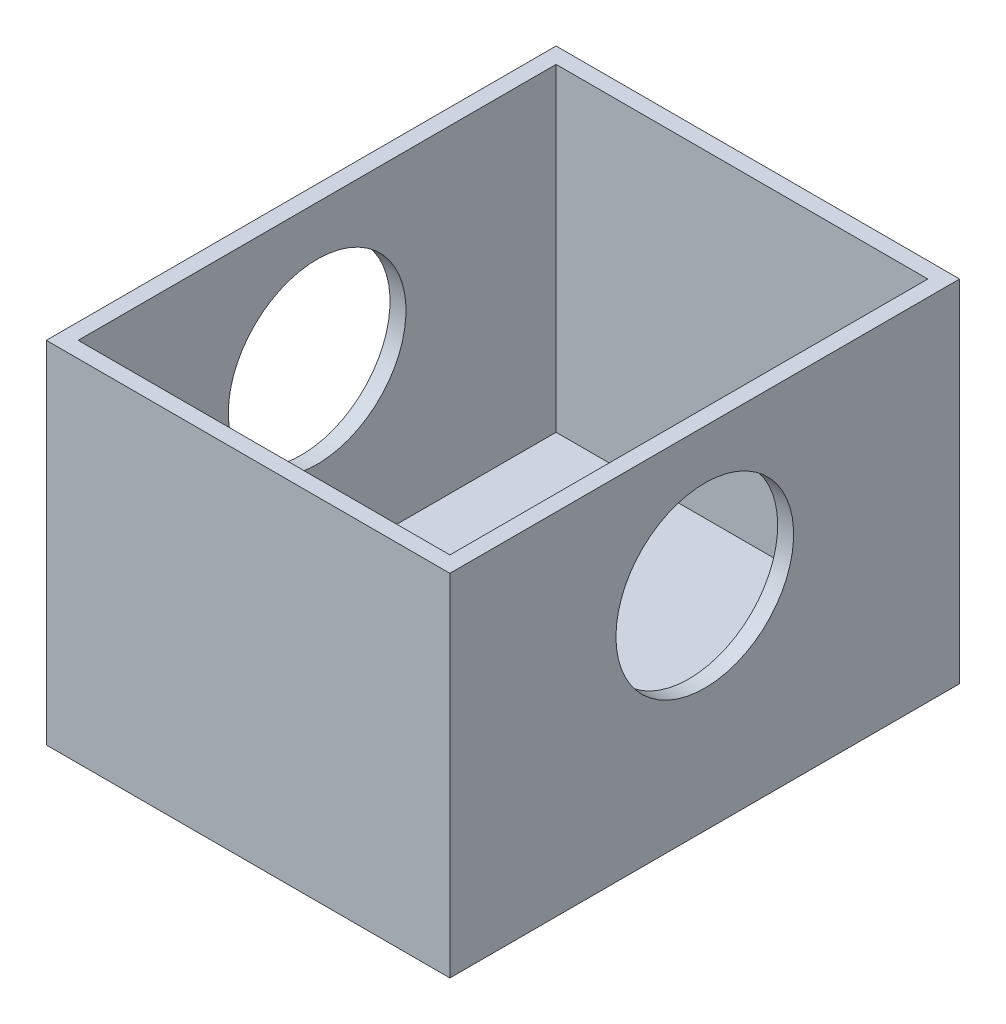
ISO-10303-21;
HEADER;
FILE_DESCRIPTION(('STEP AP214'),'2;1');
FILE_NAME('part.step','',(''),(''),'','','');
FILE_SCHEMA(('AUTOMOTIVE_DESIGN { 1 0 10303 214 1 1 1 1 }'));
ENDSEC;
DATA;
#1=APPLICATION_CONTEXT('core data for automotive mechanical design processes');
#2=APPLICATION_PROTOCOL_DEFINITION('international standard','automotive_design',2000,#1);
#3=PRODUCT_CONTEXT('',#1,'mechanical');
#4=PRODUCT('Part','Part','',(#3));
#5=PRODUCT_RELATED_PRODUCT_CATEGORY('part','',(#4));
#6=PRODUCT_DEFINITION_FORMATION('','',#4);
#7=PRODUCT_DEFINITION_CONTEXT('part definition',#1,'design');
#8=PRODUCT_DEFINITION('design','',#6,#7);
#9=PRODUCT_DEFINITION_SHAPE('','',#8);
#10=(LENGTH_UNIT() NAMED_UNIT(*) SI_UNIT(.MILLI.,.METRE.));
#11=(NAMED_UNIT(*) PLANE_ANGLE_UNIT() SI_UNIT($,.RADIAN.));
#12=(NAMED_UNIT(*) SI_UNIT($,.STERADIAN.) SOLID_ANGLE_UNIT());
#13=UNCERTAINTY_MEASURE_WITH_UNIT(LENGTH_MEASURE(1.E-05),#10,'distance_accuracy_value','');
#14=(GEOMETRIC_REPRESENTATION_CONTEXT(3) GLOBAL_UNCERTAINTY_ASSIGNED_CONTEXT((#13)) GLOBAL_UNIT_ASSIGNED_CONTEXT((#10,
#11,#12)) REPRESENTATION_CONTEXT('',''));
#15=CARTESIAN_POINT('',(0.,0.,0.));
#16=DIRECTION('',(0.,0.,1.));
#17=DIRECTION('',(1.,0.,0.));
#18=AXIS2_PLACEMENT_3D('',#15,#16,#17);
#19=CARTESIAN_POINT('',(1.68419917012448,8.382,-7.57573443983403));
#20=DIRECTION('',(0.,0.,1.));
#21=DIRECTION('',(1.,0.,0.));
#22=AXIS2_PLACEMENT_3D('',#19,#20,#21);
#23=PLANE('',#22);
#24=DIRECTION('',(-1.,0.,0.));
#25=VECTOR('',#24,1.);
#26=CARTESIAN_POINT('',(1.68419917012448,0.,-7.57573443983403));
#27=LINE('',#26,#25);
#28=CARTESIAN_POINT('',(1.68419917012448,0.,-7.57573443983403));
#29=VERTEX_POINT('',#28);
#30=CARTESIAN_POINT('',(-7.96780082987552,0.,-7.57573443983402));
#31=VERTEX_POINT('',#30);
#32=EDGE_CURVE('E162',#29,#31,#27,.T.);
#33=ORIENTED_EDGE('',*,*,#32,.T.);
#34=DIRECTION('',(0.,-1.,0.));
#35=VECTOR('',#34,1.);
#36=CARTESIAN_POINT('',(-7.96780082987552,8.382,-7.57573443983402));
#37=LINE('',#36,#35);
#38=CARTESIAN_POINT('',(-7.96780082987552,8.382,-7.57573443983402));
#39=VERTEX_POINT('',#38);
#40=EDGE_CURVE('E11',#39,#31,#37,.T.);
#41=ORIENTED_EDGE('',*,*,#40,.F.);
#42=DIRECTION('',(-1.,0.,0.));
#43=VECTOR('',#42,1.);
#44=CARTESIAN_POINT('',(1.68419917012448,8.382,-7.57573443983403));
#45=LINE('',#44,#43);
#46=CARTESIAN_POINT('',(1.68419917012448,8.382,-7.57573443983403));
#47=VERTEX_POINT('',#46);
#48=EDGE_CURVE('E168',#47,#39,#45,.T.);
#49=ORIENTED_EDGE('',*,*,#48,.F.);
#50=DIRECTION('',(0.,-1.,0.));
#51=VECTOR('',#50,1.);
#52=CARTESIAN_POINT('',(1.68419917012448,8.382,-7.57573443983403));
#53=LINE('',#52,#51);
#54=EDGE_CURVE('E178',#47,#29,#53,.T.);
#55=ORIENTED_EDGE('',*,*,#54,.T.);
#56=EDGE_LOOP('',(#33,#41,#49,#55));
#57=FACE_BOUND('',#56,.T.);
#58=ADVANCED_FACE('F39',(#57),#23,.F.);
#59=CARTESIAN_POINT('',(-7.96780082987552,8.382,-7.57573443983402));
#60=DIRECTION('',(1.,0.,0.));
#61=DIRECTION('',(0.,0.,-1.));
#62=AXIS2_PLACEMENT_3D('',#59,#60,#61);
#63=PLANE('',#62);
#64=CARTESIAN_POINT('',(-7.96780082987552,5.08,-1.47973443983403));
#65=DIRECTION('',(-1.,0.,0.));
#66=DIRECTION('',(0.,0.,1.));
#67=AXIS2_PLACEMENT_3D('',#64,#65,#66);
#68=CIRCLE('',#67,2.12471);
#69=CARTESIAN_POINT('',(-7.96780082987552,5.08,0.644975560165975));
#70=VERTEX_POINT('',#69);
#71=EDGE_CURVE('E232',#70,#70,#68,.T.);
#72=ORIENTED_EDGE('',*,*,#71,.F.);
#73=EDGE_LOOP('',(#72));
#74=FACE_BOUND('',#73,.T.);
#75=DIRECTION('',(0.,0.,1.));
#76=VECTOR('',#75,1.);
#77=CARTESIAN_POINT('',(-7.96780082987552,0.,-7.57573443983402));
#78=LINE('',#77,#76);
#79=CARTESIAN_POINT('',(-7.96780082987552,0.,4.61626556016598));
#80=VERTEX_POINT('',#79);
#81=EDGE_CURVE('E182',#31,#80,#78,.T.);
#82=ORIENTED_EDGE('',*,*,#81,.T.);
#83=DIRECTION('',(0.,-1.,0.));
#84=VECTOR('',#83,1.);
#85=CARTESIAN_POINT('',(-7.96780082987552,8.382,4.61626556016598));
#86=LINE('',#85,#84);
#87=CARTESIAN_POINT('',(-7.96780082987552,8.382,4.61626556016598));
#88=VERTEX_POINT('',#87);
#89=EDGE_CURVE('E48',#88,#80,#86,.T.);
#90=ORIENTED_EDGE('',*,*,#89,.F.);
#91=DIRECTION('',(0.,0.,1.));
#92=VECTOR('',#91,1.);
#93=CARTESIAN_POINT('',(-7.96780082987552,8.382,-7.57573443983402));
#94=LINE('',#93,#92);
#95=EDGE_CURVE('E92',#39,#88,#94,.T.);
#96=ORIENTED_EDGE('',*,*,#95,.F.);
#97=ORIENTED_EDGE('',*,*,#40,.T.);
#98=EDGE_LOOP('',(#82,#90,#96,#97));
#99=FACE_BOUND('',#98,.T.);
#100=ADVANCED_FACE('F219',(#74,#99),#63,.F.);
#101=CARTESIAN_POINT('',(-7.96780082987552,8.382,4.61626556016598));
#102=DIRECTION('',(0.,0.,-1.));
#103=DIRECTION('',(-1.,0.,0.));
#104=AXIS2_PLACEMENT_3D('',#101,#102,#103);
#105=PLANE('',#104);
#106=DIRECTION('',(1.,0.,0.));
#107=VECTOR('',#106,1.);
#108=CARTESIAN_POINT('',(-7.96780082987552,0.,4.61626556016598));
#109=LINE('',#108,#107);
#110=CARTESIAN_POINT('',(1.68419917012448,0.,4.61626556016598));
#111=VERTEX_POINT('',#110);
#112=EDGE_CURVE('E185',#80,#111,#109,.T.);
#113=ORIENTED_EDGE('',*,*,#112,.T.);
#114=DIRECTION('',(0.,-1.,0.));
#115=VECTOR('',#114,1.);
#116=CARTESIAN_POINT('',(1.68419917012448,8.382,4.61626556016598));
#117=LINE('',#116,#115);
#118=CARTESIAN_POINT('',(1.68419917012448,8.382,4.61626556016598));
#119=VERTEX_POINT('',#118);
#120=EDGE_CURVE('E192',#119,#111,#117,.T.);
#121=ORIENTED_EDGE('',*,*,#120,.F.);
#122=DIRECTION('',(1.,0.,0.));
#123=VECTOR('',#122,1.);
#124=CARTESIAN_POINT('',(-7.96780082987552,8.382,4.61626556016598));
#125=LINE('',#124,#123);
#126=EDGE_CURVE('E173',#88,#119,#125,.T.);
#127=ORIENTED_EDGE('',*,*,#126,.F.);
#128=ORIENTED_EDGE('',*,*,#89,.T.);
#129=EDGE_LOOP('',(#113,#121,#127,#128));
#130=FACE_BOUND('',#129,.T.);
#131=ADVANCED_FACE('F200',(#130),#105,.F.);
#132=CARTESIAN_POINT('',(1.68419917012448,8.382,4.61626556016598));
#133=DIRECTION('',(-1.,0.,0.));
#134=DIRECTION('',(0.,0.,1.));
#135=AXIS2_PLACEMENT_3D('',#132,#133,#134);
#136=PLANE('',#135);
#137=CARTESIAN_POINT('',(1.68419917012448,5.08,-1.47973443983403));
#138=DIRECTION('',(-1.,0.,0.));
#139=DIRECTION('',(0.,0.,1.));
#140=AXIS2_PLACEMENT_3D('',#137,#138,#139);
#141=CIRCLE('',#140,2.12471);
#142=CARTESIAN_POINT('',(1.68419917012448,5.08,0.644975560165975));
#143=VERTEX_POINT('',#142);
#144=EDGE_CURVE('E235',#143,#143,#141,.T.);
#145=ORIENTED_EDGE('',*,*,#144,.T.);
#146=EDGE_LOOP('',(#145));
#147=FACE_BOUND('',#146,.T.);
#148=DIRECTION('',(0.,0.,-1.));
#149=VECTOR('',#148,1.);
#150=CARTESIAN_POINT('',(1.68419917012448,0.,4.61626556016598));
#151=LINE('',#150,#149);
#152=EDGE_CURVE('E85',#111,#29,#151,.T.);
#153=ORIENTED_EDGE('',*,*,#152,.T.);
#154=ORIENTED_EDGE('',*,*,#54,.F.);
#155=DIRECTION('',(0.,0.,-1.));
#156=VECTOR('',#155,1.);
#157=CARTESIAN_POINT('',(1.68419917012448,8.382,4.61626556016598));
#158=LINE('',#157,#156);
#159=EDGE_CURVE('E64',#119,#47,#158,.T.);
#160=ORIENTED_EDGE('',*,*,#159,.F.);
#161=ORIENTED_EDGE('',*,*,#120,.T.);
#162=EDGE_LOOP('',(#153,#154,#160,#161));
#163=FACE_BOUND('',#162,.T.);
#164=ADVANCED_FACE('F208',(#147,#163),#136,.F.);
#165=CARTESIAN_POINT('',(0.,8.382,0.));
#166=DIRECTION('',(0.,1.,0.));
#167=DIRECTION('',(0.,0.,1.));
#168=AXIS2_PLACEMENT_3D('',#165,#166,#167);
#169=PLANE('',#168);
#170=DIRECTION('',(1.,0.,0.));
#171=VECTOR('',#170,1.);
#172=CARTESIAN_POINT('',(-7.58680082987552,8.382,4.23526556016597));
#173=LINE('',#172,#171);
#174=CARTESIAN_POINT('',(-7.58680082987552,8.382,4.23526556016597));
#175=VERTEX_POINT('',#174);
#176=CARTESIAN_POINT('',(1.30319917012448,8.382,4.23526556016597));
#177=VERTEX_POINT('',#176);
#178=EDGE_CURVE('E55',#175,#177,#173,.T.);
#179=ORIENTED_EDGE('',*,*,#178,.F.);
#180=DIRECTION('',(0.,0.,1.));
#181=VECTOR('',#180,1.);
#182=CARTESIAN_POINT('',(-7.58680082987552,8.382,-7.19473443983402));
#183=LINE('',#182,#181);
#184=CARTESIAN_POINT('',(-7.58680082987552,8.382,-7.19473443983402));
#185=VERTEX_POINT('',#184);
#186=EDGE_CURVE('E137',#185,#175,#183,.T.);
#187=ORIENTED_EDGE('',*,*,#186,.F.);
#188=DIRECTION('',(-1.,0.,0.));
#189=VECTOR('',#188,1.);
#190=CARTESIAN_POINT('',(1.30319917012448,8.382,-7.19473443983403));
#191=LINE('',#190,#189);
#192=CARTESIAN_POINT('',(1.30319917012448,8.382,-7.19473443983403));
#193=VERTEX_POINT('',#192);
#194=EDGE_CURVE('E141',#193,#185,#191,.T.);
#195=ORIENTED_EDGE('',*,*,#194,.F.);
#196=DIRECTION('',(0.,0.,-1.));
#197=VECTOR('',#196,1.);
#198=CARTESIAN_POINT('',(1.30319917012448,8.382,4.23526556016597));
#199=LINE('',#198,#197);
#200=EDGE_CURVE('E153',#177,#193,#199,.T.);
#201=ORIENTED_EDGE('',*,*,#200,.F.);
#202=EDGE_LOOP('',(#179,#187,#195,#201));
#203=FACE_BOUND('',#202,.T.);
#204=ORIENTED_EDGE('',*,*,#48,.T.);
#205=ORIENTED_EDGE('',*,*,#95,.T.);
#206=ORIENTED_EDGE('',*,*,#126,.T.);
#207=ORIENTED_EDGE('',*,*,#159,.T.);
#208=EDGE_LOOP('',(#204,#205,#206,#207));
#209=FACE_BOUND('',#208,.T.);
#210=ADVANCED_FACE('F210',(#203,#209),#169,.T.);
#211=CARTESIAN_POINT('',(0.,0.,0.));
#212=DIRECTION('',(0.,1.,0.));
#213=DIRECTION('',(0.,0.,1.));
#214=AXIS2_PLACEMENT_3D('',#211,#212,#213);
#215=PLANE('',#214);
#216=ORIENTED_EDGE('',*,*,#32,.F.);
#217=ORIENTED_EDGE('',*,*,#152,.F.);
#218=ORIENTED_EDGE('',*,*,#112,.F.);
#219=ORIENTED_EDGE('',*,*,#81,.F.);
#220=EDGE_LOOP('',(#216,#217,#218,#219));
#221=FACE_BOUND('',#220,.T.);
#222=ADVANCED_FACE('F204',(#221),#215,.F.);
#223=CARTESIAN_POINT('',(-7.58680082987552,0.762000000000001,4.23526556016597));
#224=DIRECTION('',(0.,0.,1.));
#225=DIRECTION('',(1.,0.,0.));
#226=AXIS2_PLACEMENT_3D('',#223,#224,#225);
#227=PLANE('',#226);
#228=ORIENTED_EDGE('',*,*,#178,.T.);
#229=DIRECTION('',(0.,1.,0.));
#230=VECTOR('',#229,1.);
#231=CARTESIAN_POINT('',(1.30319917012448,0.762000000000001,4.23526556016597));
#232=LINE('',#231,#230);
#233=CARTESIAN_POINT('',(1.30319917012448,0.762000000000001,4.23526556016597));
#234=VERTEX_POINT('',#233);
#235=EDGE_CURVE('E112',#234,#177,#232,.T.);
#236=ORIENTED_EDGE('',*,*,#235,.F.);
#237=DIRECTION('',(1.,0.,0.));
#238=VECTOR('',#237,1.);
#239=CARTESIAN_POINT('',(-7.58680082987552,0.762000000000001,4.23526556016597));
#240=LINE('',#239,#238);
#241=CARTESIAN_POINT('',(-7.58680082987552,0.762000000000001,4.23526556016597));
#242=VERTEX_POINT('',#241);
#243=EDGE_CURVE('E116',#242,#234,#240,.T.);
#244=ORIENTED_EDGE('',*,*,#243,.F.);
#245=DIRECTION('',(0.,1.,0.));
#246=VECTOR('',#245,1.);
#247=CARTESIAN_POINT('',(-7.58680082987552,0.762000000000001,4.23526556016597));
#248=LINE('',#247,#246);
#249=EDGE_CURVE('E159',#242,#175,#248,.T.);
#250=ORIENTED_EDGE('',*,*,#249,.T.);
#251=EDGE_LOOP('',(#228,#236,#244,#250));
#252=FACE_BOUND('',#251,.T.);
#253=ADVANCED_FACE('F114',(#252),#227,.F.);
#254=CARTESIAN_POINT('',(-7.58680082987552,0.762000000000001,-7.19473443983402));
#255=DIRECTION('',(-1.,0.,0.));
#256=DIRECTION('',(0.,0.,1.));
#257=AXIS2_PLACEMENT_3D('',#254,#255,#256);
#258=PLANE('',#257);
#259=CARTESIAN_POINT('',(-7.58680082987552,5.08,-1.47973443983403));
#260=DIRECTION('',(-1.,0.,0.));
#261=DIRECTION('',(0.,0.,1.));
#262=AXIS2_PLACEMENT_3D('',#259,#260,#261);
#263=CIRCLE('',#262,2.12471);
#264=CARTESIAN_POINT('',(-7.58680082987552,5.08,0.644975560165975));
#265=VERTEX_POINT('',#264);
#266=EDGE_CURVE('E144',#265,#265,#263,.T.);
#267=ORIENTED_EDGE('',*,*,#266,.T.);
#268=EDGE_LOOP('',(#267));
#269=FACE_BOUND('',#268,.T.);
#270=ORIENTED_EDGE('',*,*,#186,.T.);
#271=ORIENTED_EDGE('',*,*,#249,.F.);
#272=DIRECTION('',(0.,0.,1.));
#273=VECTOR('',#272,1.);
#274=CARTESIAN_POINT('',(-7.58680082987552,0.762000000000001,-7.19473443983402));
#275=LINE('',#274,#273);
#276=CARTESIAN_POINT('',(-7.58680082987552,0.762000000000001,-7.19473443983402));
#277=VERTEX_POINT('',#276);
#278=EDGE_CURVE('E123',#277,#242,#275,.T.);
#279=ORIENTED_EDGE('',*,*,#278,.F.);
#280=DIRECTION('',(0.,1.,0.));
#281=VECTOR('',#280,1.);
#282=CARTESIAN_POINT('',(-7.58680082987552,0.762000000000001,-7.19473443983402));
#283=LINE('',#282,#281);
#284=EDGE_CURVE('E163',#277,#185,#283,.T.);
#285=ORIENTED_EDGE('',*,*,#284,.T.);
#286=EDGE_LOOP('',(#270,#271,#279,#285));
#287=FACE_BOUND('',#286,.T.);
#288=ADVANCED_FACE('F247',(#269,#287),#258,.F.);
#289=CARTESIAN_POINT('',(1.30319917012448,0.762000000000001,-7.19473443983403));
#290=DIRECTION('',(0.,0.,-1.));
#291=DIRECTION('',(-1.,0.,0.));
#292=AXIS2_PLACEMENT_3D('',#289,#290,#291);
#293=PLANE('',#292);
#294=ORIENTED_EDGE('',*,*,#194,.T.);
#295=ORIENTED_EDGE('',*,*,#284,.F.);
#296=DIRECTION('',(-1.,0.,0.));
#297=VECTOR('',#296,1.);
#298=CARTESIAN_POINT('',(1.30319917012448,0.762000000000001,-7.19473443983403));
#299=LINE('',#298,#297);
#300=CARTESIAN_POINT('',(1.30319917012448,0.762000000000001,-7.19473443983403));
#301=VERTEX_POINT('',#300);
#302=EDGE_CURVE('E132',#301,#277,#299,.T.);
#303=ORIENTED_EDGE('',*,*,#302,.F.);
#304=DIRECTION('',(0.,1.,0.));
#305=VECTOR('',#304,1.);
#306=CARTESIAN_POINT('',(1.30319917012448,0.762000000000001,-7.19473443983403));
#307=LINE('',#306,#305);
#308=EDGE_CURVE('E122',#301,#193,#307,.T.);
#309=ORIENTED_EDGE('',*,*,#308,.T.);
#310=EDGE_LOOP('',(#294,#295,#303,#309));
#311=FACE_BOUND('',#310,.T.);
#312=ADVANCED_FACE('F263',(#311),#293,.F.);
#313=CARTESIAN_POINT('',(1.30319917012448,0.762000000000001,4.23526556016597));
#314=DIRECTION('',(1.,0.,0.));
#315=DIRECTION('',(0.,0.,-1.));
#316=AXIS2_PLACEMENT_3D('',#313,#314,#315);
#317=PLANE('',#316);
#318=CARTESIAN_POINT('',(1.30319917012448,5.08,-1.47973443983403));
#319=DIRECTION('',(1.,0.,0.));
#320=DIRECTION('',(0.,0.,-1.));
#321=AXIS2_PLACEMENT_3D('',#318,#319,#320);
#322=CIRCLE('',#321,2.12471);
#323=CARTESIAN_POINT('',(1.30319917012448,5.08,-3.60444443983403));
#324=VERTEX_POINT('',#323);
#325=EDGE_CURVE('E42',#324,#324,#322,.T.);
#326=ORIENTED_EDGE('',*,*,#325,.T.);
#327=EDGE_LOOP('',(#326));
#328=FACE_BOUND('',#327,.T.);
#329=ORIENTED_EDGE('',*,*,#200,.T.);
#330=ORIENTED_EDGE('',*,*,#308,.F.);
#331=DIRECTION('',(0.,0.,-1.));
#332=VECTOR('',#331,1.);
#333=CARTESIAN_POINT('',(1.30319917012448,0.762000000000001,4.23526556016597));
#334=LINE('',#333,#332);
#335=EDGE_CURVE('E126',#234,#301,#334,.T.);
#336=ORIENTED_EDGE('',*,*,#335,.F.);
#337=ORIENTED_EDGE('',*,*,#235,.T.);
#338=EDGE_LOOP('',(#329,#330,#336,#337));
#339=FACE_BOUND('',#338,.T.);
#340=ADVANCED_FACE('F127',(#328,#339),#317,.F.);
#341=CARTESIAN_POINT('',(0.,0.762000000000001,0.));
#342=DIRECTION('',(0.,1.,0.));
#343=DIRECTION('',(0.,0.,1.));
#344=AXIS2_PLACEMENT_3D('',#341,#342,#343);
#345=PLANE('',#344);
#346=ORIENTED_EDGE('',*,*,#243,.T.);
#347=ORIENTED_EDGE('',*,*,#335,.T.);
#348=ORIENTED_EDGE('',*,*,#302,.T.);
#349=ORIENTED_EDGE('',*,*,#278,.T.);
#350=EDGE_LOOP('',(#346,#347,#348,#349));
#351=FACE_BOUND('',#350,.T.);
#352=ADVANCED_FACE('F134',(#351),#345,.T.);
#353=CARTESIAN_POINT('',(1.68419917012448,5.08,-1.47973443983403));
#354=DIRECTION('',(-1.,0.,0.));
#355=DIRECTION('',(0.,0.,1.));
#356=AXIS2_PLACEMENT_3D('',#353,#354,#355);
#357=CYLINDRICAL_SURFACE('',#356,2.12471);
#358=ORIENTED_EDGE('',*,*,#144,.F.);
#359=EDGE_LOOP('',(#358));
#360=FACE_BOUND('',#359,.T.);
#361=ORIENTED_EDGE('',*,*,#325,.F.);
#362=EDGE_LOOP('',(#361));
#363=FACE_BOUND('',#362,.T.);
#364=ADVANCED_FACE('F252',(#360,#363),#357,.F.);
#365=ORIENTED_EDGE('',*,*,#71,.T.);
#366=EDGE_LOOP('',(#365));
#367=FACE_BOUND('',#366,.T.);
#368=ORIENTED_EDGE('',*,*,#266,.F.);
#369=EDGE_LOOP('',(#368));
#370=FACE_BOUND('',#369,.T.);
#371=ADVANCED_FACE('F250',(#367,#370),#357,.F.);
#372=CLOSED_SHELL('',(#58,#100,#131,#164,#210,#222,#253,#288,#312,#340,#352,#364,#371));
#373=MANIFOLD_SOLID_BREP('B2',#372);
#374=ADVANCED_BREP_SHAPE_REPRESENTATION('',(#18,#373),#14);
#375=SHAPE_DEFINITION_REPRESENTATION(#9,#374);
ENDSEC;
END-ISO-10303-21;
